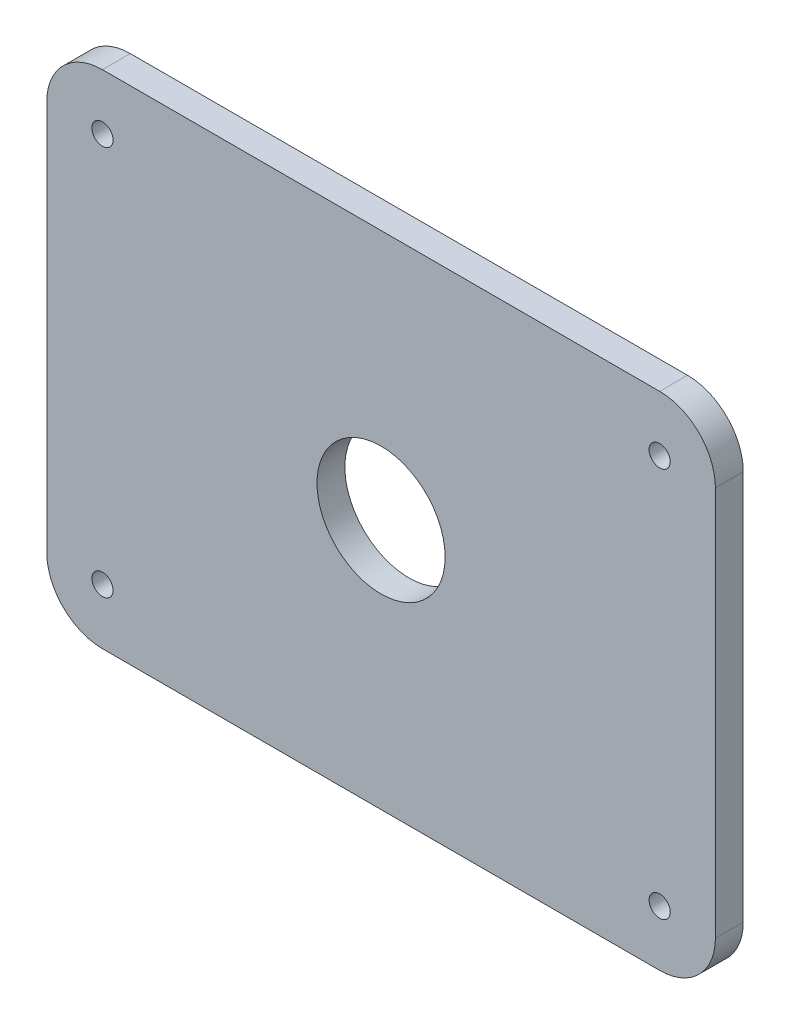
ISO-10303-21;
HEADER;
FILE_DESCRIPTION(('STEP AP214'),'2;1');
FILE_NAME('part.step','',(''),(''),'','','');
FILE_SCHEMA(('AUTOMOTIVE_DESIGN { 1 0 10303 214 1 1 1 1 }'));
ENDSEC;
DATA;
#1=APPLICATION_CONTEXT('core data for automotive mechanical design processes');
#2=APPLICATION_PROTOCOL_DEFINITION('international standard','automotive_design',2000,#1);
#3=PRODUCT_CONTEXT('',#1,'mechanical');
#4=PRODUCT('Part','Part','',(#3));
#5=PRODUCT_RELATED_PRODUCT_CATEGORY('part','',(#4));
#6=PRODUCT_DEFINITION_FORMATION('','',#4);
#7=PRODUCT_DEFINITION_CONTEXT('part definition',#1,'design');
#8=PRODUCT_DEFINITION('design','',#6,#7);
#9=PRODUCT_DEFINITION_SHAPE('','',#8);
#10=(LENGTH_UNIT() NAMED_UNIT(*) SI_UNIT(.MILLI.,.METRE.));
#11=(NAMED_UNIT(*) PLANE_ANGLE_UNIT() SI_UNIT($,.RADIAN.));
#12=(NAMED_UNIT(*) SI_UNIT($,.STERADIAN.) SOLID_ANGLE_UNIT());
#13=UNCERTAINTY_MEASURE_WITH_UNIT(LENGTH_MEASURE(1.E-05),#10,'distance_accuracy_value','');
#14=(GEOMETRIC_REPRESENTATION_CONTEXT(3) GLOBAL_UNCERTAINTY_ASSIGNED_CONTEXT((#13)) GLOBAL_UNIT_ASSIGNED_CONTEXT((#10,
#11,#12)) REPRESENTATION_CONTEXT('',''));
#15=CARTESIAN_POINT('',(0.,0.,0.));
#16=DIRECTION('',(0.,0.,1.));
#17=DIRECTION('',(1.,0.,0.));
#18=AXIS2_PLACEMENT_3D('',#15,#16,#17);
#19=CARTESIAN_POINT('',(-50.,-35.,5.));
#20=DIRECTION('',(0.,0.,1.));
#21=DIRECTION('',(1.,0.,0.));
#22=AXIS2_PLACEMENT_3D('',#19,#20,#21);
#23=PLANE('',#22);
#24=CARTESIAN_POINT('',(-50.,-35.,5.));
#25=DIRECTION('',(0.,0.,1.));
#26=DIRECTION('',(1.,0.,0.));
#27=AXIS2_PLACEMENT_3D('',#24,#25,#26);
#28=CIRCLE('',#27,1.9);
#29=CARTESIAN_POINT('',(-48.1,-35.,5.));
#30=VERTEX_POINT('',#29);
#31=EDGE_CURVE('E200',#30,#30,#28,.T.);
#32=ORIENTED_EDGE('',*,*,#31,.F.);
#33=EDGE_LOOP('',(#32));
#34=FACE_BOUND('',#33,.T.);
#35=CARTESIAN_POINT('',(50.,35.,5.));
#36=DIRECTION('',(0.,0.,1.));
#37=DIRECTION('',(1.,0.,0.));
#38=AXIS2_PLACEMENT_3D('',#35,#36,#37);
#39=CIRCLE('',#38,1.9);
#40=CARTESIAN_POINT('',(51.9,35.,5.));
#41=VERTEX_POINT('',#40);
#42=EDGE_CURVE('E188',#41,#41,#39,.T.);
#43=ORIENTED_EDGE('',*,*,#42,.F.);
#44=EDGE_LOOP('',(#43));
#45=FACE_BOUND('',#44,.T.);
#46=CARTESIAN_POINT('',(-50.,-35.,5.));
#47=DIRECTION('',(0.,0.,1.));
#48=DIRECTION('',(1.,0.,0.));
#49=AXIS2_PLACEMENT_3D('',#46,#47,#48);
#50=CIRCLE('',#49,10.);
#51=CARTESIAN_POINT('',(-60.,-34.9999999999999,5.));
#52=VERTEX_POINT('',#51);
#53=CARTESIAN_POINT('',(-49.9999999999999,-45.,5.));
#54=VERTEX_POINT('',#53);
#55=EDGE_CURVE('E151',#52,#54,#50,.T.);
#56=ORIENTED_EDGE('',*,*,#55,.T.);
#57=DIRECTION('',(1.,0.,0.));
#58=VECTOR('',#57,1.);
#59=CARTESIAN_POINT('',(-49.9999999999999,-45.,5.));
#60=LINE('',#59,#58);
#61=CARTESIAN_POINT('',(50.,-45.,5.));
#62=VERTEX_POINT('',#61);
#63=EDGE_CURVE('E99',#54,#62,#60,.T.);
#64=ORIENTED_EDGE('',*,*,#63,.T.);
#65=CARTESIAN_POINT('',(50.,-35.,5.));
#66=DIRECTION('',(0.,0.,1.));
#67=DIRECTION('',(1.,0.,0.));
#68=AXIS2_PLACEMENT_3D('',#65,#66,#67);
#69=CIRCLE('',#68,10.);
#70=CARTESIAN_POINT('',(60.,-34.9999999999999,5.));
#71=VERTEX_POINT('',#70);
#72=EDGE_CURVE('E166',#62,#71,#69,.T.);
#73=ORIENTED_EDGE('',*,*,#72,.T.);
#74=DIRECTION('',(0.,1.,0.));
#75=VECTOR('',#74,1.);
#76=CARTESIAN_POINT('',(60.,34.9999999999999,5.));
#77=LINE('',#76,#75);
#78=CARTESIAN_POINT('',(60.,34.9999999999999,5.));
#79=VERTEX_POINT('',#78);
#80=EDGE_CURVE('E179',#71,#79,#77,.T.);
#81=ORIENTED_EDGE('',*,*,#80,.T.);
#82=CARTESIAN_POINT('',(50.,35.,5.));
#83=DIRECTION('',(0.,0.,1.));
#84=DIRECTION('',(1.,0.,0.));
#85=AXIS2_PLACEMENT_3D('',#82,#83,#84);
#86=CIRCLE('',#85,10.);
#87=CARTESIAN_POINT('',(49.9999999999999,45.,5.));
#88=VERTEX_POINT('',#87);
#89=EDGE_CURVE('E118',#79,#88,#86,.T.);
#90=ORIENTED_EDGE('',*,*,#89,.T.);
#91=DIRECTION('',(-1.,0.,0.));
#92=VECTOR('',#91,1.);
#93=CARTESIAN_POINT('',(-49.9999999999999,45.,5.));
#94=LINE('',#93,#92);
#95=CARTESIAN_POINT('',(-49.9999999999999,45.,5.));
#96=VERTEX_POINT('',#95);
#97=EDGE_CURVE('E112',#88,#96,#94,.T.);
#98=ORIENTED_EDGE('',*,*,#97,.T.);
#99=CARTESIAN_POINT('',(-50.,35.,5.));
#100=DIRECTION('',(0.,0.,1.));
#101=DIRECTION('',(1.,0.,0.));
#102=AXIS2_PLACEMENT_3D('',#99,#100,#101);
#103=CIRCLE('',#102,10.);
#104=CARTESIAN_POINT('',(-60.,34.9999999999999,5.));
#105=VERTEX_POINT('',#104);
#106=EDGE_CURVE('E116',#96,#105,#103,.T.);
#107=ORIENTED_EDGE('',*,*,#106,.T.);
#108=DIRECTION('',(0.,-1.,0.));
#109=VECTOR('',#108,1.);
#110=CARTESIAN_POINT('',(-60.,34.9999999999999,5.));
#111=LINE('',#110,#109);
#112=EDGE_CURVE('E56',#105,#52,#111,.T.);
#113=ORIENTED_EDGE('',*,*,#112,.T.);
#114=EDGE_LOOP('',(#56,#64,#73,#81,#90,#98,#107,#113));
#115=FACE_BOUND('',#114,.T.);
#116=CARTESIAN_POINT('',(-50.,35.,5.));
#117=DIRECTION('',(0.,0.,1.));
#118=DIRECTION('',(1.,0.,0.));
#119=AXIS2_PLACEMENT_3D('',#116,#117,#118);
#120=CIRCLE('',#119,1.9);
#121=CARTESIAN_POINT('',(-48.1,35.,5.));
#122=VERTEX_POINT('',#121);
#123=EDGE_CURVE('E140',#122,#122,#120,.T.);
#124=ORIENTED_EDGE('',*,*,#123,.F.);
#125=EDGE_LOOP('',(#124));
#126=FACE_BOUND('',#125,.T.);
#127=CARTESIAN_POINT('',(50.,-35.,5.));
#128=DIRECTION('',(0.,0.,1.));
#129=DIRECTION('',(1.,0.,0.));
#130=AXIS2_PLACEMENT_3D('',#127,#128,#129);
#131=CIRCLE('',#130,1.9);
#132=CARTESIAN_POINT('',(51.9,-35.,5.));
#133=VERTEX_POINT('',#132);
#134=EDGE_CURVE('E194',#133,#133,#131,.T.);
#135=ORIENTED_EDGE('',*,*,#134,.F.);
#136=EDGE_LOOP('',(#135));
#137=FACE_BOUND('',#136,.T.);
#138=CARTESIAN_POINT('',(0.,0.,5.));
#139=DIRECTION('',(0.,0.,1.));
#140=DIRECTION('',(1.,0.,0.));
#141=AXIS2_PLACEMENT_3D('',#138,#139,#140);
#142=CIRCLE('',#141,11.5);
#143=CARTESIAN_POINT('',(11.5,0.,5.));
#144=VERTEX_POINT('',#143);
#145=EDGE_CURVE('E206',#144,#144,#142,.T.);
#146=ORIENTED_EDGE('',*,*,#145,.F.);
#147=EDGE_LOOP('',(#146));
#148=FACE_BOUND('',#147,.T.);
#149=ADVANCED_FACE('F39',(#34,#45,#115,#126,#137,#148),#23,.T.);
#150=CARTESIAN_POINT('',(-50.,-35.,0.));
#151=DIRECTION('',(0.,0.,1.));
#152=DIRECTION('',(1.,0.,0.));
#153=AXIS2_PLACEMENT_3D('',#150,#151,#152);
#154=PLANE('',#153);
#155=CARTESIAN_POINT('',(-50.,-35.,0.));
#156=DIRECTION('',(0.,0.,1.));
#157=DIRECTION('',(1.,0.,0.));
#158=AXIS2_PLACEMENT_3D('',#155,#156,#157);
#159=CIRCLE('',#158,10.);
#160=CARTESIAN_POINT('',(-60.,-34.9999999999999,0.));
#161=VERTEX_POINT('',#160);
#162=CARTESIAN_POINT('',(-49.9999999999999,-45.,0.));
#163=VERTEX_POINT('',#162);
#164=EDGE_CURVE('E136',#161,#163,#159,.T.);
#165=ORIENTED_EDGE('',*,*,#164,.F.);
#166=DIRECTION('',(0.,-1.,0.));
#167=VECTOR('',#166,1.);
#168=CARTESIAN_POINT('',(-60.,34.9999999999999,0.));
#169=LINE('',#168,#167);
#170=CARTESIAN_POINT('',(-60.,34.9999999999999,0.));
#171=VERTEX_POINT('',#170);
#172=EDGE_CURVE('E91',#171,#161,#169,.T.);
#173=ORIENTED_EDGE('',*,*,#172,.F.);
#174=CARTESIAN_POINT('',(-50.,35.,0.));
#175=DIRECTION('',(0.,0.,1.));
#176=DIRECTION('',(1.,0.,0.));
#177=AXIS2_PLACEMENT_3D('',#174,#175,#176);
#178=CIRCLE('',#177,10.);
#179=CARTESIAN_POINT('',(-49.9999999999999,45.,0.));
#180=VERTEX_POINT('',#179);
#181=EDGE_CURVE('E85',#180,#171,#178,.T.);
#182=ORIENTED_EDGE('',*,*,#181,.F.);
#183=DIRECTION('',(-1.,0.,0.));
#184=VECTOR('',#183,1.);
#185=CARTESIAN_POINT('',(-49.9999999999999,45.,0.));
#186=LINE('',#185,#184);
#187=CARTESIAN_POINT('',(49.9999999999999,45.,0.));
#188=VERTEX_POINT('',#187);
#189=EDGE_CURVE('E126',#188,#180,#186,.T.);
#190=ORIENTED_EDGE('',*,*,#189,.F.);
#191=CARTESIAN_POINT('',(50.,35.,0.));
#192=DIRECTION('',(0.,0.,1.));
#193=DIRECTION('',(1.,0.,0.));
#194=AXIS2_PLACEMENT_3D('',#191,#192,#193);
#195=CIRCLE('',#194,10.);
#196=CARTESIAN_POINT('',(60.,34.9999999999999,0.));
#197=VERTEX_POINT('',#196);
#198=EDGE_CURVE('E146',#197,#188,#195,.T.);
#199=ORIENTED_EDGE('',*,*,#198,.F.);
#200=DIRECTION('',(0.,1.,0.));
#201=VECTOR('',#200,1.);
#202=CARTESIAN_POINT('',(60.,34.9999999999999,0.));
#203=LINE('',#202,#201);
#204=CARTESIAN_POINT('',(60.,-34.9999999999999,0.));
#205=VERTEX_POINT('',#204);
#206=EDGE_CURVE('E144',#205,#197,#203,.T.);
#207=ORIENTED_EDGE('',*,*,#206,.F.);
#208=CARTESIAN_POINT('',(50.,-35.,0.));
#209=DIRECTION('',(0.,0.,1.));
#210=DIRECTION('',(1.,0.,0.));
#211=AXIS2_PLACEMENT_3D('',#208,#209,#210);
#212=CIRCLE('',#211,10.);
#213=CARTESIAN_POINT('',(50.,-45.,0.));
#214=VERTEX_POINT('',#213);
#215=EDGE_CURVE('E142',#214,#205,#212,.T.);
#216=ORIENTED_EDGE('',*,*,#215,.F.);
#217=DIRECTION('',(1.,0.,0.));
#218=VECTOR('',#217,1.);
#219=CARTESIAN_POINT('',(-49.9999999999999,-45.,0.));
#220=LINE('',#219,#218);
#221=EDGE_CURVE('E139',#163,#214,#220,.T.);
#222=ORIENTED_EDGE('',*,*,#221,.F.);
#223=EDGE_LOOP('',(#165,#173,#182,#190,#199,#207,#216,#222));
#224=FACE_BOUND('',#223,.T.);
#225=CARTESIAN_POINT('',(-50.,35.,0.));
#226=DIRECTION('',(0.,0.,1.));
#227=DIRECTION('',(1.,0.,0.));
#228=AXIS2_PLACEMENT_3D('',#225,#226,#227);
#229=CIRCLE('',#228,1.9);
#230=CARTESIAN_POINT('',(-48.1,35.,0.));
#231=VERTEX_POINT('',#230);
#232=EDGE_CURVE('E185',#231,#231,#229,.T.);
#233=ORIENTED_EDGE('',*,*,#232,.T.);
#234=EDGE_LOOP('',(#233));
#235=FACE_BOUND('',#234,.T.);
#236=CARTESIAN_POINT('',(50.,35.,0.));
#237=DIRECTION('',(0.,0.,1.));
#238=DIRECTION('',(1.,0.,0.));
#239=AXIS2_PLACEMENT_3D('',#236,#237,#238);
#240=CIRCLE('',#239,1.9);
#241=CARTESIAN_POINT('',(51.9,35.,0.));
#242=VERTEX_POINT('',#241);
#243=EDGE_CURVE('E191',#242,#242,#240,.T.);
#244=ORIENTED_EDGE('',*,*,#243,.T.);
#245=EDGE_LOOP('',(#244));
#246=FACE_BOUND('',#245,.T.);
#247=CARTESIAN_POINT('',(50.,-35.,0.));
#248=DIRECTION('',(0.,0.,1.));
#249=DIRECTION('',(1.,0.,0.));
#250=AXIS2_PLACEMENT_3D('',#247,#248,#249);
#251=CIRCLE('',#250,1.9);
#252=CARTESIAN_POINT('',(51.9,-35.,0.));
#253=VERTEX_POINT('',#252);
#254=EDGE_CURVE('E197',#253,#253,#251,.T.);
#255=ORIENTED_EDGE('',*,*,#254,.T.);
#256=EDGE_LOOP('',(#255));
#257=FACE_BOUND('',#256,.T.);
#258=CARTESIAN_POINT('',(-50.,-35.,0.));
#259=DIRECTION('',(0.,0.,1.));
#260=DIRECTION('',(1.,0.,0.));
#261=AXIS2_PLACEMENT_3D('',#258,#259,#260);
#262=CIRCLE('',#261,1.9);
#263=CARTESIAN_POINT('',(-48.1,-35.,0.));
#264=VERTEX_POINT('',#263);
#265=EDGE_CURVE('E203',#264,#264,#262,.T.);
#266=ORIENTED_EDGE('',*,*,#265,.T.);
#267=EDGE_LOOP('',(#266));
#268=FACE_BOUND('',#267,.T.);
#269=CARTESIAN_POINT('',(0.,0.,0.));
#270=DIRECTION('',(0.,0.,1.));
#271=DIRECTION('',(1.,0.,0.));
#272=AXIS2_PLACEMENT_3D('',#269,#270,#271);
#273=CIRCLE('',#272,11.5);
#274=CARTESIAN_POINT('',(11.5,0.,0.));
#275=VERTEX_POINT('',#274);
#276=EDGE_CURVE('E209',#275,#275,#273,.T.);
#277=ORIENTED_EDGE('',*,*,#276,.T.);
#278=EDGE_LOOP('',(#277));
#279=FACE_BOUND('',#278,.T.);
#280=ADVANCED_FACE('F170',(#224,#235,#246,#257,#268,#279),#154,.F.);
#281=CARTESIAN_POINT('',(-50.,-35.,5.));
#282=DIRECTION('',(0.,0.,-1.));
#283=DIRECTION('',(-1.,0.,0.));
#284=AXIS2_PLACEMENT_3D('',#281,#282,#283);
#285=CYLINDRICAL_SURFACE('',#284,10.);
#286=ORIENTED_EDGE('',*,*,#164,.T.);
#287=DIRECTION('',(0.,0.,-1.));
#288=VECTOR('',#287,1.);
#289=CARTESIAN_POINT('',(-49.9999999999999,-45.,5.));
#290=LINE('',#289,#288);
#291=EDGE_CURVE('E11',#54,#163,#290,.T.);
#292=ORIENTED_EDGE('',*,*,#291,.F.);
#293=ORIENTED_EDGE('',*,*,#55,.F.);
#294=DIRECTION('',(0.,0.,-1.));
#295=VECTOR('',#294,1.);
#296=CARTESIAN_POINT('',(-60.,-34.9999999999999,5.));
#297=LINE('',#296,#295);
#298=EDGE_CURVE('E132',#52,#161,#297,.T.);
#299=ORIENTED_EDGE('',*,*,#298,.T.);
#300=EDGE_LOOP('',(#286,#292,#293,#299));
#301=FACE_BOUND('',#300,.T.);
#302=ADVANCED_FACE('F41',(#301),#285,.T.);
#303=CARTESIAN_POINT('',(-49.9999999999999,-45.,5.));
#304=DIRECTION('',(0.,1.,0.));
#305=DIRECTION('',(0.,0.,1.));
#306=AXIS2_PLACEMENT_3D('',#303,#304,#305);
#307=PLANE('',#306);
#308=ORIENTED_EDGE('',*,*,#221,.T.);
#309=DIRECTION('',(0.,0.,-1.));
#310=VECTOR('',#309,1.);
#311=CARTESIAN_POINT('',(50.,-45.,5.));
#312=LINE('',#311,#310);
#313=EDGE_CURVE('E48',#62,#214,#312,.T.);
#314=ORIENTED_EDGE('',*,*,#313,.F.);
#315=ORIENTED_EDGE('',*,*,#63,.F.);
#316=ORIENTED_EDGE('',*,*,#291,.T.);
#317=EDGE_LOOP('',(#308,#314,#315,#316));
#318=FACE_BOUND('',#317,.T.);
#319=ADVANCED_FACE('F243',(#318),#307,.F.);
#320=CARTESIAN_POINT('',(50.,-35.,5.));
#321=DIRECTION('',(0.,0.,-1.));
#322=DIRECTION('',(-1.,0.,0.));
#323=AXIS2_PLACEMENT_3D('',#320,#321,#322);
#324=CYLINDRICAL_SURFACE('',#323,10.);
#325=ORIENTED_EDGE('',*,*,#215,.T.);
#326=DIRECTION('',(0.,0.,-1.));
#327=VECTOR('',#326,1.);
#328=CARTESIAN_POINT('',(60.,-34.9999999999999,5.));
#329=LINE('',#328,#327);
#330=EDGE_CURVE('E158',#71,#205,#329,.T.);
#331=ORIENTED_EDGE('',*,*,#330,.F.);
#332=ORIENTED_EDGE('',*,*,#72,.F.);
#333=ORIENTED_EDGE('',*,*,#313,.T.);
#334=EDGE_LOOP('',(#325,#331,#332,#333));
#335=FACE_BOUND('',#334,.T.);
#336=ADVANCED_FACE('F164',(#335),#324,.T.);
#337=CARTESIAN_POINT('',(60.,34.9999999999999,5.));
#338=DIRECTION('',(-1.,0.,0.));
#339=DIRECTION('',(0.,-1.,0.));
#340=AXIS2_PLACEMENT_3D('',#337,#338,#339);
#341=PLANE('',#340);
#342=ORIENTED_EDGE('',*,*,#206,.T.);
#343=DIRECTION('',(0.,0.,-1.));
#344=VECTOR('',#343,1.);
#345=CARTESIAN_POINT('',(60.,34.9999999999999,5.));
#346=LINE('',#345,#344);
#347=EDGE_CURVE('E155',#79,#197,#346,.T.);
#348=ORIENTED_EDGE('',*,*,#347,.F.);
#349=ORIENTED_EDGE('',*,*,#80,.F.);
#350=ORIENTED_EDGE('',*,*,#330,.T.);
#351=EDGE_LOOP('',(#342,#348,#349,#350));
#352=FACE_BOUND('',#351,.T.);
#353=ADVANCED_FACE('F175',(#352),#341,.F.);
#354=CARTESIAN_POINT('',(50.,35.,5.));
#355=DIRECTION('',(0.,0.,-1.));
#356=DIRECTION('',(-1.,0.,0.));
#357=AXIS2_PLACEMENT_3D('',#354,#355,#356);
#358=CYLINDRICAL_SURFACE('',#357,10.);
#359=ORIENTED_EDGE('',*,*,#198,.T.);
#360=DIRECTION('',(0.,0.,-1.));
#361=VECTOR('',#360,1.);
#362=CARTESIAN_POINT('',(49.9999999999999,45.,5.));
#363=LINE('',#362,#361);
#364=EDGE_CURVE('E127',#88,#188,#363,.T.);
#365=ORIENTED_EDGE('',*,*,#364,.F.);
#366=ORIENTED_EDGE('',*,*,#89,.F.);
#367=ORIENTED_EDGE('',*,*,#347,.T.);
#368=EDGE_LOOP('',(#359,#365,#366,#367));
#369=FACE_BOUND('',#368,.T.);
#370=ADVANCED_FACE('F178',(#369),#358,.T.);
#371=CARTESIAN_POINT('',(-49.9999999999999,45.,5.));
#372=DIRECTION('',(0.,-1.,0.));
#373=DIRECTION('',(0.,0.,-1.));
#374=AXIS2_PLACEMENT_3D('',#371,#372,#373);
#375=PLANE('',#374);
#376=ORIENTED_EDGE('',*,*,#189,.T.);
#377=DIRECTION('',(0.,0.,-1.));
#378=VECTOR('',#377,1.);
#379=CARTESIAN_POINT('',(-49.9999999999999,45.,5.));
#380=LINE('',#379,#378);
#381=EDGE_CURVE('E123',#96,#180,#380,.T.);
#382=ORIENTED_EDGE('',*,*,#381,.F.);
#383=ORIENTED_EDGE('',*,*,#97,.F.);
#384=ORIENTED_EDGE('',*,*,#364,.T.);
#385=EDGE_LOOP('',(#376,#382,#383,#384));
#386=FACE_BOUND('',#385,.T.);
#387=ADVANCED_FACE('F124',(#386),#375,.F.);
#388=CARTESIAN_POINT('',(-50.,35.,5.));
#389=DIRECTION('',(0.,0.,-1.));
#390=DIRECTION('',(-1.,0.,0.));
#391=AXIS2_PLACEMENT_3D('',#388,#389,#390);
#392=CYLINDRICAL_SURFACE('',#391,10.);
#393=ORIENTED_EDGE('',*,*,#181,.T.);
#394=DIRECTION('',(0.,0.,-1.));
#395=VECTOR('',#394,1.);
#396=CARTESIAN_POINT('',(-60.,34.9999999999999,5.));
#397=LINE('',#396,#395);
#398=EDGE_CURVE('E128',#105,#171,#397,.T.);
#399=ORIENTED_EDGE('',*,*,#398,.F.);
#400=ORIENTED_EDGE('',*,*,#106,.F.);
#401=ORIENTED_EDGE('',*,*,#381,.T.);
#402=EDGE_LOOP('',(#393,#399,#400,#401));
#403=FACE_BOUND('',#402,.T.);
#404=ADVANCED_FACE('F130',(#403),#392,.T.);
#405=CARTESIAN_POINT('',(-60.,34.9999999999999,5.));
#406=DIRECTION('',(1.,0.,0.));
#407=DIRECTION('',(0.,1.,0.));
#408=AXIS2_PLACEMENT_3D('',#405,#406,#407);
#409=PLANE('',#408);
#410=ORIENTED_EDGE('',*,*,#172,.T.);
#411=ORIENTED_EDGE('',*,*,#298,.F.);
#412=ORIENTED_EDGE('',*,*,#112,.F.);
#413=ORIENTED_EDGE('',*,*,#398,.T.);
#414=EDGE_LOOP('',(#410,#411,#412,#413));
#415=FACE_BOUND('',#414,.T.);
#416=ADVANCED_FACE('F231',(#415),#409,.F.);
#417=CARTESIAN_POINT('',(-50.,35.,5.));
#418=DIRECTION('',(0.,0.,-1.));
#419=DIRECTION('',(-1.,0.,0.));
#420=AXIS2_PLACEMENT_3D('',#417,#418,#419);
#421=CYLINDRICAL_SURFACE('',#420,1.9);
#422=ORIENTED_EDGE('',*,*,#123,.T.);
#423=EDGE_LOOP('',(#422));
#424=FACE_BOUND('',#423,.T.);
#425=ORIENTED_EDGE('',*,*,#232,.F.);
#426=EDGE_LOOP('',(#425));
#427=FACE_BOUND('',#426,.T.);
#428=ADVANCED_FACE('F228',(#424,#427),#421,.F.);
#429=CARTESIAN_POINT('',(50.,35.,5.));
#430=DIRECTION('',(0.,0.,-1.));
#431=DIRECTION('',(-1.,0.,0.));
#432=AXIS2_PLACEMENT_3D('',#429,#430,#431);
#433=CYLINDRICAL_SURFACE('',#432,1.9);
#434=ORIENTED_EDGE('',*,*,#42,.T.);
#435=EDGE_LOOP('',(#434));
#436=FACE_BOUND('',#435,.T.);
#437=ORIENTED_EDGE('',*,*,#243,.F.);
#438=EDGE_LOOP('',(#437));
#439=FACE_BOUND('',#438,.T.);
#440=ADVANCED_FACE('F306',(#436,#439),#433,.F.);
#441=CARTESIAN_POINT('',(50.,-35.,5.));
#442=DIRECTION('',(0.,0.,-1.));
#443=DIRECTION('',(-1.,0.,0.));
#444=AXIS2_PLACEMENT_3D('',#441,#442,#443);
#445=CYLINDRICAL_SURFACE('',#444,1.9);
#446=ORIENTED_EDGE('',*,*,#134,.T.);
#447=EDGE_LOOP('',(#446));
#448=FACE_BOUND('',#447,.T.);
#449=ORIENTED_EDGE('',*,*,#254,.F.);
#450=EDGE_LOOP('',(#449));
#451=FACE_BOUND('',#450,.T.);
#452=ADVANCED_FACE('F314',(#448,#451),#445,.F.);
#453=CARTESIAN_POINT('',(-50.,-35.,5.));
#454=DIRECTION('',(0.,0.,-1.));
#455=DIRECTION('',(-1.,0.,0.));
#456=AXIS2_PLACEMENT_3D('',#453,#454,#455);
#457=CYLINDRICAL_SURFACE('',#456,1.9);
#458=ORIENTED_EDGE('',*,*,#31,.T.);
#459=EDGE_LOOP('',(#458));
#460=FACE_BOUND('',#459,.T.);
#461=ORIENTED_EDGE('',*,*,#265,.F.);
#462=EDGE_LOOP('',(#461));
#463=FACE_BOUND('',#462,.T.);
#464=ADVANCED_FACE('F322',(#460,#463),#457,.F.);
#465=CARTESIAN_POINT('',(0.,0.,5.));
#466=DIRECTION('',(0.,0.,-1.));
#467=DIRECTION('',(-1.,0.,0.));
#468=AXIS2_PLACEMENT_3D('',#465,#466,#467);
#469=CYLINDRICAL_SURFACE('',#468,11.5);
#470=ORIENTED_EDGE('',*,*,#145,.T.);
#471=EDGE_LOOP('',(#470));
#472=FACE_BOUND('',#471,.T.);
#473=ORIENTED_EDGE('',*,*,#276,.F.);
#474=EDGE_LOOP('',(#473));
#475=FACE_BOUND('',#474,.T.);
#476=ADVANCED_FACE('F215',(#472,#475),#469,.F.);
#477=CLOSED_SHELL('',(#149,#280,#302,#319,#336,#353,#370,#387,#404,#416,#428,#440,#452,#464,#476));
#478=MANIFOLD_SOLID_BREP('B2',#477);
#479=ADVANCED_BREP_SHAPE_REPRESENTATION('',(#18,#478),#14);
#480=SHAPE_DEFINITION_REPRESENTATION(#9,#479);
ENDSEC;
END-ISO-10303-21;
